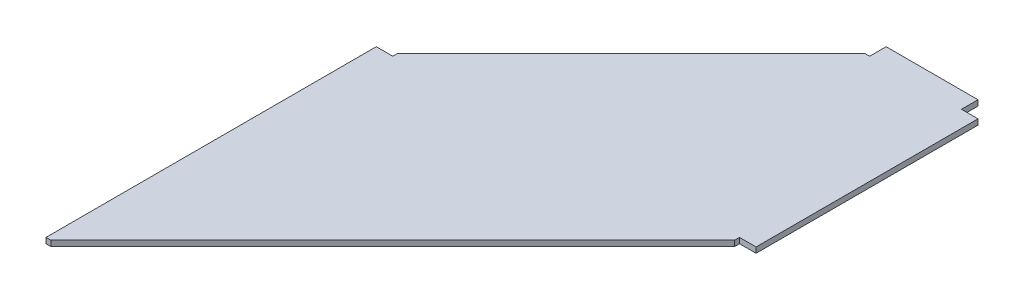
ISO-10303-21;
HEADER;
FILE_DESCRIPTION(('STEP AP214'),'2;1');
FILE_NAME('part.step','',(''),(''),'','','');
FILE_SCHEMA(('AUTOMOTIVE_DESIGN { 1 0 10303 214 1 1 1 1 }'));
ENDSEC;
DATA;
#1=APPLICATION_CONTEXT('core data for automotive mechanical design processes');
#2=APPLICATION_PROTOCOL_DEFINITION('international standard','automotive_design',2000,#1);
#3=PRODUCT_CONTEXT('',#1,'mechanical');
#4=PRODUCT('Part','Part','',(#3));
#5=PRODUCT_RELATED_PRODUCT_CATEGORY('part','',(#4));
#6=PRODUCT_DEFINITION_FORMATION('','',#4);
#7=PRODUCT_DEFINITION_CONTEXT('part definition',#1,'design');
#8=PRODUCT_DEFINITION('design','',#6,#7);
#9=PRODUCT_DEFINITION_SHAPE('','',#8);
#10=(LENGTH_UNIT() NAMED_UNIT(*) SI_UNIT(.MILLI.,.METRE.));
#11=(NAMED_UNIT(*) PLANE_ANGLE_UNIT() SI_UNIT($,.RADIAN.));
#12=(NAMED_UNIT(*) SI_UNIT($,.STERADIAN.) SOLID_ANGLE_UNIT());
#13=UNCERTAINTY_MEASURE_WITH_UNIT(LENGTH_MEASURE(1.E-05),#10,'distance_accuracy_value','');
#14=(GEOMETRIC_REPRESENTATION_CONTEXT(3) GLOBAL_UNCERTAINTY_ASSIGNED_CONTEXT((#13)) GLOBAL_UNIT_ASSIGNED_CONTEXT((#10,
#11,#12)) REPRESENTATION_CONTEXT('',''));
#15=CARTESIAN_POINT('',(0.,0.,0.));
#16=DIRECTION('',(0.,0.,1.));
#17=DIRECTION('',(1.,0.,0.));
#18=AXIS2_PLACEMENT_3D('',#15,#16,#17);
#19=CARTESIAN_POINT('',(-452.252273699884,12.7,1112.95189519651));
#20=DIRECTION('',(1.,0.,0.));
#21=DIRECTION('',(0.,0.,-1.));
#22=AXIS2_PLACEMENT_3D('',#19,#20,#21);
#23=PLANE('',#22);
#24=DIRECTION('',(0.,0.,1.));
#25=VECTOR('',#24,1.);
#26=CARTESIAN_POINT('',(-452.252273699884,0.,1112.95189519651));
#27=LINE('',#26,#25);
#28=CARTESIAN_POINT('',(-452.252273699884,0.,351.051895196507));
#29=VERTEX_POINT('',#28);
#30=CARTESIAN_POINT('',(-452.252273699884,0.,1112.95189519651));
#31=VERTEX_POINT('',#30);
#32=EDGE_CURVE('E171',#29,#31,#27,.T.);
#33=ORIENTED_EDGE('',*,*,#32,.T.);
#34=DIRECTION('',(0.,-1.,0.));
#35=VECTOR('',#34,1.);
#36=CARTESIAN_POINT('',(-452.252273699884,12.7,1112.95189519651));
#37=LINE('',#36,#35);
#38=CARTESIAN_POINT('',(-452.252273699884,12.7,1112.95189519651));
#39=VERTEX_POINT('',#38);
#40=EDGE_CURVE('E11',#39,#31,#37,.T.);
#41=ORIENTED_EDGE('',*,*,#40,.F.);
#42=DIRECTION('',(0.,0.,1.));
#43=VECTOR('',#42,1.);
#44=CARTESIAN_POINT('',(-452.252273699884,12.7,1112.95189519651));
#45=LINE('',#44,#43);
#46=CARTESIAN_POINT('',(-452.252273699884,12.7,351.051895196507));
#47=VERTEX_POINT('',#46);
#48=EDGE_CURVE('E197',#47,#39,#45,.T.);
#49=ORIENTED_EDGE('',*,*,#48,.F.);
#50=DIRECTION('',(0.,-1.,0.));
#51=VECTOR('',#50,1.);
#52=CARTESIAN_POINT('',(-452.252273699884,12.7,351.051895196507));
#53=LINE('',#52,#51);
#54=EDGE_CURVE('E167',#47,#29,#53,.T.);
#55=ORIENTED_EDGE('',*,*,#54,.T.);
#56=EDGE_LOOP('',(#33,#41,#49,#55));
#57=FACE_BOUND('',#56,.T.);
#58=ADVANCED_FACE('F39',(#57),#23,.F.);
#59=CARTESIAN_POINT('',(-452.252273699884,12.7,1112.95189519651));
#60=DIRECTION('',(0.,0.,-1.));
#61=DIRECTION('',(-1.,0.,0.));
#62=AXIS2_PLACEMENT_3D('',#59,#60,#61);
#63=PLANE('',#62);
#64=DIRECTION('',(1.,0.,0.));
#65=VECTOR('',#64,1.);
#66=CARTESIAN_POINT('',(-452.252273699884,0.,1112.95189519651));
#67=LINE('',#66,#65);
#68=CARTESIAN_POINT('',(-441.052273699884,0.,1112.95189519651));
#69=VERTEX_POINT('',#68);
#70=EDGE_CURVE('E174',#31,#69,#67,.T.);
#71=ORIENTED_EDGE('',*,*,#70,.T.);
#72=DIRECTION('',(0.,-1.,0.));
#73=VECTOR('',#72,1.);
#74=CARTESIAN_POINT('',(-441.052273699884,12.7,1112.95189519651));
#75=LINE('',#74,#73);
#76=CARTESIAN_POINT('',(-441.052273699884,12.7,1112.95189519651));
#77=VERTEX_POINT('',#76);
#78=EDGE_CURVE('E47',#77,#69,#75,.T.);
#79=ORIENTED_EDGE('',*,*,#78,.F.);
#80=DIRECTION('',(1.,0.,0.));
#81=VECTOR('',#80,1.);
#82=CARTESIAN_POINT('',(-452.252273699884,12.7,1112.95189519651));
#83=LINE('',#82,#81);
#84=EDGE_CURVE('E116',#39,#77,#83,.T.);
#85=ORIENTED_EDGE('',*,*,#84,.F.);
#86=ORIENTED_EDGE('',*,*,#40,.T.);
#87=EDGE_LOOP('',(#71,#79,#85,#86));
#88=FACE_BOUND('',#87,.T.);
#89=ADVANCED_FACE('F285',(#88),#63,.F.);
#90=CARTESIAN_POINT('',(347.747726300116,12.7,324.251895196507));
#91=DIRECTION('',(-0.707061955247275,0.,-0.707151604284329));
#92=DIRECTION('',(-0.707151604284329,0.,0.707061955247275));
#93=AXIS2_PLACEMENT_3D('',#90,#91,#92);
#94=PLANE('',#93);
#95=DIRECTION('',(0.707151604284329,0.,-0.707061955247275));
#96=VECTOR('',#95,1.);
#97=CARTESIAN_POINT('',(347.747726300116,0.,324.251895196507));
#98=LINE('',#97,#96);
#99=CARTESIAN_POINT('',(347.747726300116,0.,324.251895196507));
#100=VERTEX_POINT('',#99);
#101=EDGE_CURVE('E176',#69,#100,#98,.T.);
#102=ORIENTED_EDGE('',*,*,#101,.T.);
#103=DIRECTION('',(0.,-1.,0.));
#104=VECTOR('',#103,1.);
#105=CARTESIAN_POINT('',(347.747726300116,12.7,324.251895196507));
#106=LINE('',#105,#104);
#107=CARTESIAN_POINT('',(347.747726300116,12.7,324.251895196507));
#108=VERTEX_POINT('',#107);
#109=EDGE_CURVE('E222',#108,#100,#106,.T.);
#110=ORIENTED_EDGE('',*,*,#109,.F.);
#111=DIRECTION('',(0.707151604284329,0.,-0.707061955247275));
#112=VECTOR('',#111,1.);
#113=CARTESIAN_POINT('',(347.747726300116,12.7,324.251895196507));
#114=LINE('',#113,#112);
#115=EDGE_CURVE('E230',#77,#108,#114,.T.);
#116=ORIENTED_EDGE('',*,*,#115,.F.);
#117=ORIENTED_EDGE('',*,*,#78,.T.);
#118=EDGE_LOOP('',(#102,#110,#116,#117));
#119=FACE_BOUND('',#118,.T.);
#120=ADVANCED_FACE('F228',(#119),#94,.F.);
#121=CARTESIAN_POINT('',(347.747726300116,12.7,324.251895196507));
#122=DIRECTION('',(-1.,0.,0.));
#123=DIRECTION('',(0.,0.,1.));
#124=AXIS2_PLACEMENT_3D('',#121,#122,#123);
#125=PLANE('',#124);
#126=DIRECTION('',(0.,0.,-1.));
#127=VECTOR('',#126,1.);
#128=CARTESIAN_POINT('',(347.747726300116,0.,324.251895196507));
#129=LINE('',#128,#127);
#130=CARTESIAN_POINT('',(347.747726300116,0.,313.051895196507));
#131=VERTEX_POINT('',#130);
#132=EDGE_CURVE('E178',#100,#131,#129,.T.);
#133=ORIENTED_EDGE('',*,*,#132,.T.);
#134=DIRECTION('',(0.,-1.,0.));
#135=VECTOR('',#134,1.);
#136=CARTESIAN_POINT('',(347.747726300116,12.7,313.051895196507));
#137=LINE('',#136,#135);
#138=CARTESIAN_POINT('',(347.747726300116,12.7,313.051895196507));
#139=VERTEX_POINT('',#138);
#140=EDGE_CURVE('E219',#139,#131,#137,.T.);
#141=ORIENTED_EDGE('',*,*,#140,.F.);
#142=DIRECTION('',(0.,0.,-1.));
#143=VECTOR('',#142,1.);
#144=CARTESIAN_POINT('',(347.747726300116,12.7,324.251895196507));
#145=LINE('',#144,#143);
#146=EDGE_CURVE('E248',#108,#139,#145,.T.);
#147=ORIENTED_EDGE('',*,*,#146,.F.);
#148=ORIENTED_EDGE('',*,*,#109,.T.);
#149=EDGE_LOOP('',(#133,#141,#147,#148));
#150=FACE_BOUND('',#149,.T.);
#151=ADVANCED_FACE('F239',(#150),#125,.F.);
#152=CARTESIAN_POINT('',(347.747726300116,12.7,313.051895196507));
#153=DIRECTION('',(0.,0.,-1.));
#154=DIRECTION('',(-1.,0.,0.));
#155=AXIS2_PLACEMENT_3D('',#152,#153,#154);
#156=PLANE('',#155);
#157=DIRECTION('',(1.,0.,0.));
#158=VECTOR('',#157,1.);
#159=CARTESIAN_POINT('',(347.747726300116,0.,313.051895196507));
#160=LINE('',#159,#158);
#161=CARTESIAN_POINT('',(385.847726300116,0.,313.051895196507));
#162=VERTEX_POINT('',#161);
#163=EDGE_CURVE('E180',#131,#162,#160,.T.);
#164=ORIENTED_EDGE('',*,*,#163,.T.);
#165=DIRECTION('',(0.,-1.,0.));
#166=VECTOR('',#165,1.);
#167=CARTESIAN_POINT('',(385.847726300116,12.7,313.051895196507));
#168=LINE('',#167,#166);
#169=CARTESIAN_POINT('',(385.847726300116,12.7,313.051895196507));
#170=VERTEX_POINT('',#169);
#171=EDGE_CURVE('E216',#170,#162,#168,.T.);
#172=ORIENTED_EDGE('',*,*,#171,.F.);
#173=DIRECTION('',(1.,0.,0.));
#174=VECTOR('',#173,1.);
#175=CARTESIAN_POINT('',(347.747726300116,12.7,313.051895196507));
#176=LINE('',#175,#174);
#177=EDGE_CURVE('E245',#139,#170,#176,.T.);
#178=ORIENTED_EDGE('',*,*,#177,.F.);
#179=ORIENTED_EDGE('',*,*,#140,.T.);
#180=EDGE_LOOP('',(#164,#172,#178,#179));
#181=FACE_BOUND('',#180,.T.);
#182=ADVANCED_FACE('F243',(#181),#156,.F.);
#183=CARTESIAN_POINT('',(385.847726300116,12.7,313.051895196507));
#184=DIRECTION('',(-1.,0.,0.));
#185=DIRECTION('',(0.,0.,1.));
#186=AXIS2_PLACEMENT_3D('',#183,#184,#185);
#187=PLANE('',#186);
#188=DIRECTION('',(0.,0.,-1.));
#189=VECTOR('',#188,1.);
#190=CARTESIAN_POINT('',(385.847726300116,0.,313.051895196507));
#191=LINE('',#190,#189);
#192=CARTESIAN_POINT('',(385.847726300116,0.,-198.948104803494));
#193=VERTEX_POINT('',#192);
#194=EDGE_CURVE('E182',#162,#193,#191,.T.);
#195=ORIENTED_EDGE('',*,*,#194,.T.);
#196=DIRECTION('',(0.,-1.,0.));
#197=VECTOR('',#196,1.);
#198=CARTESIAN_POINT('',(385.847726300116,12.7,-198.948104803494));
#199=LINE('',#198,#197);
#200=CARTESIAN_POINT('',(385.847726300116,12.7,-198.948104803494));
#201=VERTEX_POINT('',#200);
#202=EDGE_CURVE('E213',#201,#193,#199,.T.);
#203=ORIENTED_EDGE('',*,*,#202,.F.);
#204=DIRECTION('',(0.,0.,-1.));
#205=VECTOR('',#204,1.);
#206=CARTESIAN_POINT('',(385.847726300116,12.7,313.051895196507));
#207=LINE('',#206,#205);
#208=EDGE_CURVE('E247',#170,#201,#207,.T.);
#209=ORIENTED_EDGE('',*,*,#208,.F.);
#210=ORIENTED_EDGE('',*,*,#171,.T.);
#211=EDGE_LOOP('',(#195,#203,#209,#210));
#212=FACE_BOUND('',#211,.T.);
#213=ADVANCED_FACE('F298',(#212),#187,.F.);
#214=CARTESIAN_POINT('',(347.747726300116,12.7,-198.948104803493));
#215=DIRECTION('',(0.,0.,1.));
#216=DIRECTION('',(1.,0.,0.));
#217=AXIS2_PLACEMENT_3D('',#214,#215,#216);
#218=PLANE('',#217);
#219=DIRECTION('',(-1.,0.,0.));
#220=VECTOR('',#219,1.);
#221=CARTESIAN_POINT('',(347.747726300116,0.,-198.948104803493));
#222=LINE('',#221,#220);
#223=CARTESIAN_POINT('',(347.747726300116,0.,-198.948104803493));
#224=VERTEX_POINT('',#223);
#225=EDGE_CURVE('E184',#193,#224,#222,.T.);
#226=ORIENTED_EDGE('',*,*,#225,.T.);
#227=DIRECTION('',(0.,-1.,0.));
#228=VECTOR('',#227,1.);
#229=CARTESIAN_POINT('',(347.747726300116,12.7,-198.948104803493));
#230=LINE('',#229,#228);
#231=CARTESIAN_POINT('',(347.747726300116,12.7,-198.948104803493));
#232=VERTEX_POINT('',#231);
#233=EDGE_CURVE('E210',#232,#224,#230,.T.);
#234=ORIENTED_EDGE('',*,*,#233,.F.);
#235=DIRECTION('',(-1.,0.,0.));
#236=VECTOR('',#235,1.);
#237=CARTESIAN_POINT('',(347.747726300116,12.7,-198.948104803493));
#238=LINE('',#237,#236);
#239=EDGE_CURVE('E250',#201,#232,#238,.T.);
#240=ORIENTED_EDGE('',*,*,#239,.F.);
#241=ORIENTED_EDGE('',*,*,#202,.T.);
#242=EDGE_LOOP('',(#226,#234,#240,#241));
#243=FACE_BOUND('',#242,.T.);
#244=ADVANCED_FACE('F301',(#243),#218,.F.);
#245=CARTESIAN_POINT('',(347.747726300116,12.7,-237.048104803493));
#246=DIRECTION('',(-1.,0.,0.));
#247=DIRECTION('',(0.,0.,1.));
#248=AXIS2_PLACEMENT_3D('',#245,#246,#247);
#249=PLANE('',#248);
#250=DIRECTION('',(0.,0.,-1.));
#251=VECTOR('',#250,1.);
#252=CARTESIAN_POINT('',(347.747726300116,0.,-237.048104803493));
#253=LINE('',#252,#251);
#254=CARTESIAN_POINT('',(347.747726300116,0.,-237.048104803493));
#255=VERTEX_POINT('',#254);
#256=EDGE_CURVE('E186',#224,#255,#253,.T.);
#257=ORIENTED_EDGE('',*,*,#256,.T.);
#258=DIRECTION('',(0.,-1.,0.));
#259=VECTOR('',#258,1.);
#260=CARTESIAN_POINT('',(347.747726300116,12.7,-237.048104803493));
#261=LINE('',#260,#259);
#262=CARTESIAN_POINT('',(347.747726300116,12.7,-237.048104803493));
#263=VERTEX_POINT('',#262);
#264=EDGE_CURVE('E207',#263,#255,#261,.T.);
#265=ORIENTED_EDGE('',*,*,#264,.F.);
#266=DIRECTION('',(0.,0.,-1.));
#267=VECTOR('',#266,1.);
#268=CARTESIAN_POINT('',(347.747726300116,12.7,-237.048104803493));
#269=LINE('',#268,#267);
#270=EDGE_CURVE('E256',#232,#263,#269,.T.);
#271=ORIENTED_EDGE('',*,*,#270,.F.);
#272=ORIENTED_EDGE('',*,*,#233,.T.);
#273=EDGE_LOOP('',(#257,#265,#271,#272));
#274=FACE_BOUND('',#273,.T.);
#275=ADVANCED_FACE('F305',(#274),#249,.F.);
#276=CARTESIAN_POINT('',(135.847726300116,12.7,-237.048104803494));
#277=DIRECTION('',(0.,0.,1.));
#278=DIRECTION('',(1.,0.,0.));
#279=AXIS2_PLACEMENT_3D('',#276,#277,#278);
#280=PLANE('',#279);
#281=DIRECTION('',(-1.,0.,0.));
#282=VECTOR('',#281,1.);
#283=CARTESIAN_POINT('',(135.847726300116,0.,-237.048104803494));
#284=LINE('',#283,#282);
#285=CARTESIAN_POINT('',(135.847726300116,0.,-237.048104803494));
#286=VERTEX_POINT('',#285);
#287=EDGE_CURVE('E188',#255,#286,#284,.T.);
#288=ORIENTED_EDGE('',*,*,#287,.T.);
#289=DIRECTION('',(0.,-1.,0.));
#290=VECTOR('',#289,1.);
#291=CARTESIAN_POINT('',(135.847726300116,12.7,-237.048104803494));
#292=LINE('',#291,#290);
#293=CARTESIAN_POINT('',(135.847726300116,12.7,-237.048104803494));
#294=VERTEX_POINT('',#293);
#295=EDGE_CURVE('E204',#294,#286,#292,.T.);
#296=ORIENTED_EDGE('',*,*,#295,.F.);
#297=DIRECTION('',(-1.,0.,0.));
#298=VECTOR('',#297,1.);
#299=CARTESIAN_POINT('',(135.847726300116,12.7,-237.048104803494));
#300=LINE('',#299,#298);
#301=EDGE_CURVE('E258',#263,#294,#300,.T.);
#302=ORIENTED_EDGE('',*,*,#301,.F.);
#303=ORIENTED_EDGE('',*,*,#264,.T.);
#304=EDGE_LOOP('',(#288,#296,#302,#303));
#305=FACE_BOUND('',#304,.T.);
#306=ADVANCED_FACE('F309',(#305),#280,.F.);
#307=CARTESIAN_POINT('',(135.847726300116,12.7,-198.948104803493));
#308=DIRECTION('',(1.,0.,0.));
#309=DIRECTION('',(0.,0.,-1.));
#310=AXIS2_PLACEMENT_3D('',#307,#308,#309);
#311=PLANE('',#310);
#312=DIRECTION('',(0.,0.,1.));
#313=VECTOR('',#312,1.);
#314=CARTESIAN_POINT('',(135.847726300116,0.,-198.948104803493));
#315=LINE('',#314,#313);
#316=CARTESIAN_POINT('',(135.847726300116,0.,-198.948104803493));
#317=VERTEX_POINT('',#316);
#318=EDGE_CURVE('E190',#286,#317,#315,.T.);
#319=ORIENTED_EDGE('',*,*,#318,.T.);
#320=DIRECTION('',(0.,-1.,0.));
#321=VECTOR('',#320,1.);
#322=CARTESIAN_POINT('',(135.847726300116,12.7,-198.948104803493));
#323=LINE('',#322,#321);
#324=CARTESIAN_POINT('',(135.847726300116,12.7,-198.948104803493));
#325=VERTEX_POINT('',#324);
#326=EDGE_CURVE('E201',#325,#317,#323,.T.);
#327=ORIENTED_EDGE('',*,*,#326,.F.);
#328=DIRECTION('',(0.,0.,1.));
#329=VECTOR('',#328,1.);
#330=CARTESIAN_POINT('',(135.847726300116,12.7,-198.948104803493));
#331=LINE('',#330,#329);
#332=EDGE_CURVE('E260',#294,#325,#331,.T.);
#333=ORIENTED_EDGE('',*,*,#332,.F.);
#334=ORIENTED_EDGE('',*,*,#295,.T.);
#335=EDGE_LOOP('',(#319,#327,#333,#334));
#336=FACE_BOUND('',#335,.T.);
#337=ADVANCED_FACE('F266',(#336),#311,.F.);
#338=CARTESIAN_POINT('',(124.647726300116,12.7,-198.948104803493));
#339=DIRECTION('',(0.,0.,1.));
#340=DIRECTION('',(1.,0.,0.));
#341=AXIS2_PLACEMENT_3D('',#338,#339,#340);
#342=PLANE('',#341);
#343=DIRECTION('',(-1.,0.,0.));
#344=VECTOR('',#343,1.);
#345=CARTESIAN_POINT('',(124.647726300116,0.,-198.948104803493));
#346=LINE('',#345,#344);
#347=CARTESIAN_POINT('',(124.647726300116,0.,-198.948104803493));
#348=VERTEX_POINT('',#347);
#349=EDGE_CURVE('E192',#317,#348,#346,.T.);
#350=ORIENTED_EDGE('',*,*,#349,.T.);
#351=DIRECTION('',(0.,-1.,0.));
#352=VECTOR('',#351,1.);
#353=CARTESIAN_POINT('',(124.647726300116,12.7,-198.948104803493));
#354=LINE('',#353,#352);
#355=CARTESIAN_POINT('',(124.647726300116,12.7,-198.948104803493));
#356=VERTEX_POINT('',#355);
#357=EDGE_CURVE('E162',#356,#348,#354,.T.);
#358=ORIENTED_EDGE('',*,*,#357,.F.);
#359=DIRECTION('',(-1.,0.,0.));
#360=VECTOR('',#359,1.);
#361=CARTESIAN_POINT('',(124.647726300116,12.7,-198.948104803493));
#362=LINE('',#361,#360);
#363=EDGE_CURVE('E153',#325,#356,#362,.T.);
#364=ORIENTED_EDGE('',*,*,#363,.F.);
#365=ORIENTED_EDGE('',*,*,#326,.T.);
#366=EDGE_LOOP('',(#350,#358,#364,#365));
#367=FACE_BOUND('',#366,.T.);
#368=ADVANCED_FACE('F270',(#367),#342,.F.);
#369=CARTESIAN_POINT('',(124.647726300116,12.7,-198.948104803493));
#370=DIRECTION('',(0.707106781186554,0.,0.707106781186541));
#371=DIRECTION('',(0.707106781186541,0.,-0.707106781186554));
#372=AXIS2_PLACEMENT_3D('',#369,#370,#371);
#373=PLANE('',#372);
#374=DIRECTION('',(-0.707106781186541,0.,0.707106781186554));
#375=VECTOR('',#374,1.);
#376=CARTESIAN_POINT('',(124.647726300116,0.,-198.948104803493));
#377=LINE('',#376,#375);
#378=CARTESIAN_POINT('',(-414.152273699884,0.,339.851895196516));
#379=VERTEX_POINT('',#378);
#380=EDGE_CURVE('E161',#348,#379,#377,.T.);
#381=ORIENTED_EDGE('',*,*,#380,.T.);
#382=DIRECTION('',(0.,-1.,0.));
#383=VECTOR('',#382,1.);
#384=CARTESIAN_POINT('',(-414.152273699884,12.7,339.851895196516));
#385=LINE('',#384,#383);
#386=CARTESIAN_POINT('',(-414.152273699884,12.7,339.851895196516));
#387=VERTEX_POINT('',#386);
#388=EDGE_CURVE('E158',#387,#379,#385,.T.);
#389=ORIENTED_EDGE('',*,*,#388,.F.);
#390=DIRECTION('',(-0.707106781186541,0.,0.707106781186554));
#391=VECTOR('',#390,1.);
#392=CARTESIAN_POINT('',(124.647726300116,12.7,-198.948104803493));
#393=LINE('',#392,#391);
#394=EDGE_CURVE('E147',#356,#387,#393,.T.);
#395=ORIENTED_EDGE('',*,*,#394,.F.);
#396=ORIENTED_EDGE('',*,*,#357,.T.);
#397=EDGE_LOOP('',(#381,#389,#395,#396));
#398=FACE_BOUND('',#397,.T.);
#399=ADVANCED_FACE('F159',(#398),#373,.F.);
#400=CARTESIAN_POINT('',(-414.152273699884,12.7,351.051895196507));
#401=DIRECTION('',(1.,0.,0.));
#402=DIRECTION('',(0.,0.,-1.));
#403=AXIS2_PLACEMENT_3D('',#400,#401,#402);
#404=PLANE('',#403);
#405=DIRECTION('',(0.,0.,1.));
#406=VECTOR('',#405,1.);
#407=CARTESIAN_POINT('',(-414.152273699884,0.,351.051895196507));
#408=LINE('',#407,#406);
#409=CARTESIAN_POINT('',(-414.152273699884,0.,351.051895196507));
#410=VERTEX_POINT('',#409);
#411=EDGE_CURVE('E102',#379,#410,#408,.T.);
#412=ORIENTED_EDGE('',*,*,#411,.T.);
#413=DIRECTION('',(0.,-1.,0.));
#414=VECTOR('',#413,1.);
#415=CARTESIAN_POINT('',(-414.152273699884,12.7,351.051895196507));
#416=LINE('',#415,#414);
#417=CARTESIAN_POINT('',(-414.152273699884,12.7,351.051895196507));
#418=VERTEX_POINT('',#417);
#419=EDGE_CURVE('E163',#418,#410,#416,.T.);
#420=ORIENTED_EDGE('',*,*,#419,.F.);
#421=DIRECTION('',(0.,0.,1.));
#422=VECTOR('',#421,1.);
#423=CARTESIAN_POINT('',(-414.152273699884,12.7,351.051895196507));
#424=LINE('',#423,#422);
#425=EDGE_CURVE('E151',#387,#418,#424,.T.);
#426=ORIENTED_EDGE('',*,*,#425,.F.);
#427=ORIENTED_EDGE('',*,*,#388,.T.);
#428=EDGE_LOOP('',(#412,#420,#426,#427));
#429=FACE_BOUND('',#428,.T.);
#430=ADVANCED_FACE('F165',(#429),#404,.F.);
#431=CARTESIAN_POINT('',(-452.252273699884,12.7,351.051895196507));
#432=DIRECTION('',(0.,0.,1.));
#433=DIRECTION('',(1.,0.,0.));
#434=AXIS2_PLACEMENT_3D('',#431,#432,#433);
#435=PLANE('',#434);
#436=DIRECTION('',(-1.,0.,0.));
#437=VECTOR('',#436,1.);
#438=CARTESIAN_POINT('',(-452.252273699884,0.,351.051895196507));
#439=LINE('',#438,#437);
#440=EDGE_CURVE('E108',#410,#29,#439,.T.);
#441=ORIENTED_EDGE('',*,*,#440,.T.);
#442=ORIENTED_EDGE('',*,*,#54,.F.);
#443=DIRECTION('',(-1.,0.,0.));
#444=VECTOR('',#443,1.);
#445=CARTESIAN_POINT('',(-452.252273699884,12.7,351.051895196507));
#446=LINE('',#445,#444);
#447=EDGE_CURVE('E55',#418,#47,#446,.T.);
#448=ORIENTED_EDGE('',*,*,#447,.F.);
#449=ORIENTED_EDGE('',*,*,#419,.T.);
#450=EDGE_LOOP('',(#441,#442,#448,#449));
#451=FACE_BOUND('',#450,.T.);
#452=ADVANCED_FACE('F274',(#451),#435,.F.);
#453=CARTESIAN_POINT('',(0.,12.7,0.));
#454=DIRECTION('',(0.,-1.,0.));
#455=DIRECTION('',(0.,0.,-1.));
#456=AXIS2_PLACEMENT_3D('',#453,#454,#455);
#457=PLANE('',#456);
#458=ORIENTED_EDGE('',*,*,#48,.T.);
#459=ORIENTED_EDGE('',*,*,#84,.T.);
#460=ORIENTED_EDGE('',*,*,#115,.T.);
#461=ORIENTED_EDGE('',*,*,#146,.T.);
#462=ORIENTED_EDGE('',*,*,#177,.T.);
#463=ORIENTED_EDGE('',*,*,#208,.T.);
#464=ORIENTED_EDGE('',*,*,#239,.T.);
#465=ORIENTED_EDGE('',*,*,#270,.T.);
#466=ORIENTED_EDGE('',*,*,#301,.T.);
#467=ORIENTED_EDGE('',*,*,#332,.T.);
#468=ORIENTED_EDGE('',*,*,#363,.T.);
#469=ORIENTED_EDGE('',*,*,#394,.T.);
#470=ORIENTED_EDGE('',*,*,#425,.T.);
#471=ORIENTED_EDGE('',*,*,#447,.T.);
#472=EDGE_LOOP('',(#458,#459,#460,#461,#462,#463,#464,#465,#466,#467,#468,#469,#470,#471));
#473=FACE_BOUND('',#472,.T.);
#474=ADVANCED_FACE('F149',(#473),#457,.F.);
#475=CARTESIAN_POINT('',(0.,0.,0.));
#476=DIRECTION('',(0.,-1.,0.));
#477=DIRECTION('',(0.,0.,-1.));
#478=AXIS2_PLACEMENT_3D('',#475,#476,#477);
#479=PLANE('',#478);
#480=ORIENTED_EDGE('',*,*,#32,.F.);
#481=ORIENTED_EDGE('',*,*,#440,.F.);
#482=ORIENTED_EDGE('',*,*,#411,.F.);
#483=ORIENTED_EDGE('',*,*,#380,.F.);
#484=ORIENTED_EDGE('',*,*,#349,.F.);
#485=ORIENTED_EDGE('',*,*,#318,.F.);
#486=ORIENTED_EDGE('',*,*,#287,.F.);
#487=ORIENTED_EDGE('',*,*,#256,.F.);
#488=ORIENTED_EDGE('',*,*,#225,.F.);
#489=ORIENTED_EDGE('',*,*,#194,.F.);
#490=ORIENTED_EDGE('',*,*,#163,.F.);
#491=ORIENTED_EDGE('',*,*,#132,.F.);
#492=ORIENTED_EDGE('',*,*,#101,.F.);
#493=ORIENTED_EDGE('',*,*,#70,.F.);
#494=EDGE_LOOP('',(#480,#481,#482,#483,#484,#485,#486,#487,#488,#489,#490,#491,#492,#493));
#495=FACE_BOUND('',#494,.T.);
#496=ADVANCED_FACE('F234',(#495),#479,.T.);
#497=CLOSED_SHELL('',(#58,#89,#120,#151,#182,#213,#244,#275,#306,#337,#368,#399,#430,#452,#474,#496));
#498=MANIFOLD_SOLID_BREP('B2',#497);
#499=ADVANCED_BREP_SHAPE_REPRESENTATION('',(#18,#498),#14);
#500=SHAPE_DEFINITION_REPRESENTATION(#9,#499);
ENDSEC;
END-ISO-10303-21;
